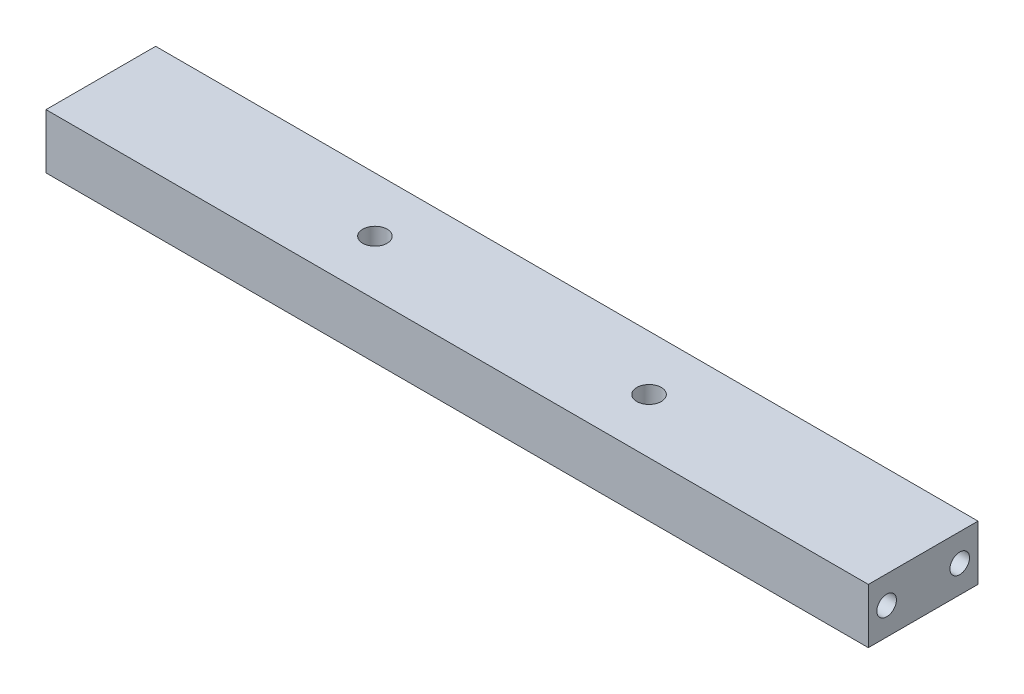
ISO-10303-21;
HEADER;
FILE_DESCRIPTION(('STEP AP214'),'2;1');
FILE_NAME('part.step','',(''),(''),'','','');
FILE_SCHEMA(('AUTOMOTIVE_DESIGN { 1 0 10303 214 1 1 1 1 }'));
ENDSEC;
DATA;
#1=APPLICATION_CONTEXT('core data for automotive mechanical design processes');
#2=APPLICATION_PROTOCOL_DEFINITION('international standard','automotive_design',2000,#1);
#3=PRODUCT_CONTEXT('',#1,'mechanical');
#4=PRODUCT('Part','Part','',(#3));
#5=PRODUCT_RELATED_PRODUCT_CATEGORY('part','',(#4));
#6=PRODUCT_DEFINITION_FORMATION('','',#4);
#7=PRODUCT_DEFINITION_CONTEXT('part definition',#1,'design');
#8=PRODUCT_DEFINITION('design','',#6,#7);
#9=PRODUCT_DEFINITION_SHAPE('','',#8);
#10=(LENGTH_UNIT() NAMED_UNIT(*) SI_UNIT(.MILLI.,.METRE.));
#11=(NAMED_UNIT(*) PLANE_ANGLE_UNIT() SI_UNIT($,.RADIAN.));
#12=(NAMED_UNIT(*) SI_UNIT($,.STERADIAN.) SOLID_ANGLE_UNIT());
#13=UNCERTAINTY_MEASURE_WITH_UNIT(LENGTH_MEASURE(1.E-05),#10,'distance_accuracy_value','');
#14=(GEOMETRIC_REPRESENTATION_CONTEXT(3) GLOBAL_UNCERTAINTY_ASSIGNED_CONTEXT((#13)) GLOBAL_UNIT_ASSIGNED_CONTEXT((#10,
#11,#12)) REPRESENTATION_CONTEXT('',''));
#15=CARTESIAN_POINT('',(0.,0.,0.));
#16=DIRECTION('',(0.,0.,1.));
#17=DIRECTION('',(1.,0.,0.));
#18=AXIS2_PLACEMENT_3D('',#15,#16,#17);
#19=CARTESIAN_POINT('',(142.875,9.525,19.05));
#20=DIRECTION('',(0.,0.,-1.));
#21=DIRECTION('',(0.,1.,0.));
#22=AXIS2_PLACEMENT_3D('',#19,#20,#21);
#23=PLANE('',#22);
#24=DIRECTION('',(0.,-1.,0.));
#25=VECTOR('',#24,1.);
#26=CARTESIAN_POINT('',(-142.875,9.525,19.05));
#27=LINE('',#26,#25);
#28=CARTESIAN_POINT('',(-142.875,9.525,19.05));
#29=VERTEX_POINT('',#28);
#30=CARTESIAN_POINT('',(-142.875,-9.525,19.05));
#31=VERTEX_POINT('',#30);
#32=EDGE_CURVE('E197',#29,#31,#27,.T.);
#33=ORIENTED_EDGE('',*,*,#32,.T.);
#34=DIRECTION('',(-1.,0.,0.));
#35=VECTOR('',#34,1.);
#36=CARTESIAN_POINT('',(142.875,-9.525,19.05));
#37=LINE('',#36,#35);
#38=CARTESIAN_POINT('',(142.875,-9.525,19.05));
#39=VERTEX_POINT('',#38);
#40=EDGE_CURVE('E11',#39,#31,#37,.T.);
#41=ORIENTED_EDGE('',*,*,#40,.F.);
#42=DIRECTION('',(0.,-1.,0.));
#43=VECTOR('',#42,1.);
#44=CARTESIAN_POINT('',(142.875,9.525,19.05));
#45=LINE('',#44,#43);
#46=CARTESIAN_POINT('',(142.875,9.525,19.05));
#47=VERTEX_POINT('',#46);
#48=EDGE_CURVE('E198',#47,#39,#45,.T.);
#49=ORIENTED_EDGE('',*,*,#48,.F.);
#50=DIRECTION('',(-1.,0.,0.));
#51=VECTOR('',#50,1.);
#52=CARTESIAN_POINT('',(142.875,9.525,19.05));
#53=LINE('',#52,#51);
#54=EDGE_CURVE('E204',#47,#29,#53,.T.);
#55=ORIENTED_EDGE('',*,*,#54,.T.);
#56=EDGE_LOOP('',(#33,#41,#49,#55));
#57=FACE_BOUND('',#56,.T.);
#58=ADVANCED_FACE('F38',(#57),#23,.F.);
#59=CARTESIAN_POINT('',(142.875,-9.525,19.05));
#60=DIRECTION('',(0.,1.,0.));
#61=DIRECTION('',(0.,0.,1.));
#62=AXIS2_PLACEMENT_3D('',#59,#60,#61);
#63=PLANE('',#62);
#64=CARTESIAN_POINT('',(19.05,-9.525,-12.7));
#65=DIRECTION('',(0.,-1.,0.));
#66=DIRECTION('',(0.,0.,-1.));
#67=AXIS2_PLACEMENT_3D('',#64,#65,#66);
#68=CIRCLE('',#67,2.1);
#69=CARTESIAN_POINT('',(19.05,-9.525,-14.8));
#70=VERTEX_POINT('',#69);
#71=EDGE_CURVE('E127',#70,#70,#68,.T.);
#72=ORIENTED_EDGE('',*,*,#71,.F.);
#73=EDGE_LOOP('',(#72));
#74=FACE_BOUND('',#73,.T.);
#75=CARTESIAN_POINT('',(-19.05,-9.525,-12.7));
#76=DIRECTION('',(0.,-1.,0.));
#77=DIRECTION('',(0.,0.,-1.));
#78=AXIS2_PLACEMENT_3D('',#75,#76,#77);
#79=CIRCLE('',#78,2.1);
#80=CARTESIAN_POINT('',(-19.05,-9.525,-14.8));
#81=VERTEX_POINT('',#80);
#82=EDGE_CURVE('E126',#81,#81,#79,.T.);
#83=ORIENTED_EDGE('',*,*,#82,.F.);
#84=EDGE_LOOP('',(#83));
#85=FACE_BOUND('',#84,.T.);
#86=CARTESIAN_POINT('',(-19.05,-9.525,12.7));
#87=DIRECTION('',(0.,-1.,0.));
#88=DIRECTION('',(0.,0.,-1.));
#89=AXIS2_PLACEMENT_3D('',#86,#87,#88);
#90=CIRCLE('',#89,2.1);
#91=CARTESIAN_POINT('',(-19.05,-9.525,10.6));
#92=VERTEX_POINT('',#91);
#93=EDGE_CURVE('E137',#92,#92,#90,.T.);
#94=ORIENTED_EDGE('',*,*,#93,.F.);
#95=EDGE_LOOP('',(#94));
#96=FACE_BOUND('',#95,.T.);
#97=CARTESIAN_POINT('',(19.05,-9.525,12.7));
#98=DIRECTION('',(0.,-1.,0.));
#99=DIRECTION('',(0.,0.,-1.));
#100=AXIS2_PLACEMENT_3D('',#97,#98,#99);
#101=CIRCLE('',#100,2.1);
#102=CARTESIAN_POINT('',(19.05,-9.525,10.6));
#103=VERTEX_POINT('',#102);
#104=EDGE_CURVE('E143',#103,#103,#101,.T.);
#105=ORIENTED_EDGE('',*,*,#104,.F.);
#106=EDGE_LOOP('',(#105));
#107=FACE_BOUND('',#106,.T.);
#108=CARTESIAN_POINT('',(-47.625,-9.525,0.));
#109=DIRECTION('',(0.,1.,0.));
#110=DIRECTION('',(0.,0.,1.));
#111=AXIS2_PLACEMENT_3D('',#108,#109,#110);
#112=CIRCLE('',#111,4.25);
#113=CARTESIAN_POINT('',(-47.625,-9.525,4.25));
#114=VERTEX_POINT('',#113);
#115=EDGE_CURVE('E164',#114,#114,#112,.T.);
#116=ORIENTED_EDGE('',*,*,#115,.T.);
#117=EDGE_LOOP('',(#116));
#118=FACE_BOUND('',#117,.T.);
#119=CARTESIAN_POINT('',(47.625,-9.525,0.));
#120=DIRECTION('',(0.,1.,0.));
#121=DIRECTION('',(0.,0.,1.));
#122=AXIS2_PLACEMENT_3D('',#119,#120,#121);
#123=CIRCLE('',#122,4.25);
#124=CARTESIAN_POINT('',(47.625,-9.525,4.25));
#125=VERTEX_POINT('',#124);
#126=EDGE_CURVE('E170',#125,#125,#123,.T.);
#127=ORIENTED_EDGE('',*,*,#126,.T.);
#128=EDGE_LOOP('',(#127));
#129=FACE_BOUND('',#128,.T.);
#130=DIRECTION('',(0.,0.,-1.));
#131=VECTOR('',#130,1.);
#132=CARTESIAN_POINT('',(-142.875,-9.525,19.05));
#133=LINE('',#132,#131);
#134=CARTESIAN_POINT('',(-142.875,-9.525,-19.05));
#135=VERTEX_POINT('',#134);
#136=EDGE_CURVE('E207',#31,#135,#133,.T.);
#137=ORIENTED_EDGE('',*,*,#136,.T.);
#138=DIRECTION('',(-1.,0.,0.));
#139=VECTOR('',#138,1.);
#140=CARTESIAN_POINT('',(142.875,-9.525,-19.05));
#141=LINE('',#140,#139);
#142=CARTESIAN_POINT('',(142.875,-9.525,-19.05));
#143=VERTEX_POINT('',#142);
#144=EDGE_CURVE('E46',#143,#135,#141,.T.);
#145=ORIENTED_EDGE('',*,*,#144,.F.);
#146=DIRECTION('',(0.,0.,-1.));
#147=VECTOR('',#146,1.);
#148=CARTESIAN_POINT('',(142.875,-9.525,19.05));
#149=LINE('',#148,#147);
#150=EDGE_CURVE('E85',#39,#143,#149,.T.);
#151=ORIENTED_EDGE('',*,*,#150,.F.);
#152=ORIENTED_EDGE('',*,*,#40,.T.);
#153=EDGE_LOOP('',(#137,#145,#151,#152));
#154=FACE_BOUND('',#153,.T.);
#155=ADVANCED_FACE('F232',(#74,#85,#96,#107,#118,#129,#154),#63,.F.);
#156=CARTESIAN_POINT('',(142.875,9.525,-19.05));
#157=DIRECTION('',(0.,0.,1.));
#158=DIRECTION('',(0.,-1.,0.));
#159=AXIS2_PLACEMENT_3D('',#156,#157,#158);
#160=PLANE('',#159);
#161=CARTESIAN_POINT('',(63.5,0.,-19.05));
#162=DIRECTION('',(0.,0.,-1.));
#163=DIRECTION('',(-1.,0.,0.));
#164=AXIS2_PLACEMENT_3D('',#161,#162,#163);
#165=CIRCLE('',#164,2.1);
#166=CARTESIAN_POINT('',(61.4,0.,-19.05));
#167=VERTEX_POINT('',#166);
#168=EDGE_CURVE('E149',#167,#167,#165,.T.);
#169=ORIENTED_EDGE('',*,*,#168,.F.);
#170=EDGE_LOOP('',(#169));
#171=FACE_BOUND('',#170,.T.);
#172=CARTESIAN_POINT('',(-63.5,0.,-19.05));
#173=DIRECTION('',(0.,0.,-1.));
#174=DIRECTION('',(-1.,0.,0.));
#175=AXIS2_PLACEMENT_3D('',#172,#173,#174);
#176=CIRCLE('',#175,2.1);
#177=CARTESIAN_POINT('',(-65.6,0.,-19.05));
#178=VERTEX_POINT('',#177);
#179=EDGE_CURVE('E155',#178,#178,#176,.T.);
#180=ORIENTED_EDGE('',*,*,#179,.F.);
#181=EDGE_LOOP('',(#180));
#182=FACE_BOUND('',#181,.T.);
#183=DIRECTION('',(0.,1.,0.));
#184=VECTOR('',#183,1.);
#185=CARTESIAN_POINT('',(-142.875,9.525,-19.05));
#186=LINE('',#185,#184);
#187=CARTESIAN_POINT('',(-142.875,9.525,-19.05));
#188=VERTEX_POINT('',#187);
#189=EDGE_CURVE('E72',#135,#188,#186,.T.);
#190=ORIENTED_EDGE('',*,*,#189,.T.);
#191=DIRECTION('',(-1.,0.,0.));
#192=VECTOR('',#191,1.);
#193=CARTESIAN_POINT('',(142.875,9.525,-19.05));
#194=LINE('',#193,#192);
#195=CARTESIAN_POINT('',(142.875,9.525,-19.05));
#196=VERTEX_POINT('',#195);
#197=EDGE_CURVE('E212',#196,#188,#194,.T.);
#198=ORIENTED_EDGE('',*,*,#197,.F.);
#199=DIRECTION('',(0.,1.,0.));
#200=VECTOR('',#199,1.);
#201=CARTESIAN_POINT('',(142.875,9.525,-19.05));
#202=LINE('',#201,#200);
#203=EDGE_CURVE('E201',#143,#196,#202,.T.);
#204=ORIENTED_EDGE('',*,*,#203,.F.);
#205=ORIENTED_EDGE('',*,*,#144,.T.);
#206=EDGE_LOOP('',(#190,#198,#204,#205));
#207=FACE_BOUND('',#206,.T.);
#208=ADVANCED_FACE('F214',(#171,#182,#207),#160,.F.);
#209=CARTESIAN_POINT('',(142.875,9.525,19.05));
#210=DIRECTION('',(0.,-1.,0.));
#211=DIRECTION('',(0.,0.,-1.));
#212=AXIS2_PLACEMENT_3D('',#209,#210,#211);
#213=PLANE('',#212);
#214=CARTESIAN_POINT('',(-47.625,9.525,0.));
#215=DIRECTION('',(0.,1.,0.));
#216=DIRECTION('',(0.,0.,1.));
#217=AXIS2_PLACEMENT_3D('',#214,#215,#216);
#218=CIRCLE('',#217,4.24999999999999);
#219=CARTESIAN_POINT('',(-47.625,9.525,4.24999999999999));
#220=VERTEX_POINT('',#219);
#221=EDGE_CURVE('E161',#220,#220,#218,.T.);
#222=ORIENTED_EDGE('',*,*,#221,.F.);
#223=EDGE_LOOP('',(#222));
#224=FACE_BOUND('',#223,.T.);
#225=CARTESIAN_POINT('',(47.625,9.525,0.));
#226=DIRECTION('',(0.,1.,0.));
#227=DIRECTION('',(0.,0.,1.));
#228=AXIS2_PLACEMENT_3D('',#225,#226,#227);
#229=CIRCLE('',#228,4.24999999999999);
#230=CARTESIAN_POINT('',(47.625,9.525,4.24999999999999));
#231=VERTEX_POINT('',#230);
#232=EDGE_CURVE('E167',#231,#231,#229,.T.);
#233=ORIENTED_EDGE('',*,*,#232,.F.);
#234=EDGE_LOOP('',(#233));
#235=FACE_BOUND('',#234,.T.);
#236=DIRECTION('',(0.,0.,1.));
#237=VECTOR('',#236,1.);
#238=CARTESIAN_POINT('',(-142.875,9.525,19.05));
#239=LINE('',#238,#237);
#240=EDGE_CURVE('E78',#188,#29,#239,.T.);
#241=ORIENTED_EDGE('',*,*,#240,.T.);
#242=ORIENTED_EDGE('',*,*,#54,.F.);
#243=DIRECTION('',(0.,0.,1.));
#244=VECTOR('',#243,1.);
#245=CARTESIAN_POINT('',(142.875,9.525,19.05));
#246=LINE('',#245,#244);
#247=EDGE_CURVE('E54',#196,#47,#246,.T.);
#248=ORIENTED_EDGE('',*,*,#247,.F.);
#249=ORIENTED_EDGE('',*,*,#197,.T.);
#250=EDGE_LOOP('',(#241,#242,#248,#249));
#251=FACE_BOUND('',#250,.T.);
#252=ADVANCED_FACE('F221',(#224,#235,#251),#213,.F.);
#253=CARTESIAN_POINT('',(142.875,9.525,19.05));
#254=DIRECTION('',(1.,0.,0.));
#255=DIRECTION('',(0.,0.,-1.));
#256=AXIS2_PLACEMENT_3D('',#253,#254,#255);
#257=PLANE('',#256);
#258=CARTESIAN_POINT('',(142.875,0.,12.7));
#259=DIRECTION('',(1.,0.,0.));
#260=DIRECTION('',(0.,0.,-1.));
#261=AXIS2_PLACEMENT_3D('',#258,#259,#260);
#262=CIRCLE('',#261,3.4);
#263=CARTESIAN_POINT('',(142.875,0.,9.3));
#264=VERTEX_POINT('',#263);
#265=EDGE_CURVE('E188',#264,#264,#262,.T.);
#266=ORIENTED_EDGE('',*,*,#265,.F.);
#267=EDGE_LOOP('',(#266));
#268=FACE_BOUND('',#267,.T.);
#269=CARTESIAN_POINT('',(142.875,0.,-12.7));
#270=DIRECTION('',(1.,0.,0.));
#271=DIRECTION('',(0.,0.,-1.));
#272=AXIS2_PLACEMENT_3D('',#269,#270,#271);
#273=CIRCLE('',#272,3.4);
#274=CARTESIAN_POINT('',(142.875,0.,-16.1));
#275=VERTEX_POINT('',#274);
#276=EDGE_CURVE('E194',#275,#275,#273,.T.);
#277=ORIENTED_EDGE('',*,*,#276,.F.);
#278=EDGE_LOOP('',(#277));
#279=FACE_BOUND('',#278,.T.);
#280=ORIENTED_EDGE('',*,*,#48,.T.);
#281=ORIENTED_EDGE('',*,*,#150,.T.);
#282=ORIENTED_EDGE('',*,*,#203,.T.);
#283=ORIENTED_EDGE('',*,*,#247,.T.);
#284=EDGE_LOOP('',(#280,#281,#282,#283));
#285=FACE_BOUND('',#284,.T.);
#286=ADVANCED_FACE('F223',(#268,#279,#285),#257,.T.);
#287=CARTESIAN_POINT('',(-142.875,9.525,19.05));
#288=DIRECTION('',(1.,0.,0.));
#289=DIRECTION('',(0.,0.,-1.));
#290=AXIS2_PLACEMENT_3D('',#287,#288,#289);
#291=PLANE('',#290);
#292=CARTESIAN_POINT('',(-142.875,0.,12.7));
#293=DIRECTION('',(-1.,0.,0.));
#294=DIRECTION('',(0.,0.,1.));
#295=AXIS2_PLACEMENT_3D('',#292,#293,#294);
#296=CIRCLE('',#295,3.4);
#297=CARTESIAN_POINT('',(-142.875,0.,16.1));
#298=VERTEX_POINT('',#297);
#299=EDGE_CURVE('E176',#298,#298,#296,.T.);
#300=ORIENTED_EDGE('',*,*,#299,.F.);
#301=EDGE_LOOP('',(#300));
#302=FACE_BOUND('',#301,.T.);
#303=CARTESIAN_POINT('',(-142.875,0.,-12.7));
#304=DIRECTION('',(-1.,0.,0.));
#305=DIRECTION('',(0.,0.,1.));
#306=AXIS2_PLACEMENT_3D('',#303,#304,#305);
#307=CIRCLE('',#306,3.4);
#308=CARTESIAN_POINT('',(-142.875,0.,-9.3));
#309=VERTEX_POINT('',#308);
#310=EDGE_CURVE('E182',#309,#309,#307,.T.);
#311=ORIENTED_EDGE('',*,*,#310,.F.);
#312=EDGE_LOOP('',(#311));
#313=FACE_BOUND('',#312,.T.);
#314=ORIENTED_EDGE('',*,*,#32,.F.);
#315=ORIENTED_EDGE('',*,*,#240,.F.);
#316=ORIENTED_EDGE('',*,*,#189,.F.);
#317=ORIENTED_EDGE('',*,*,#136,.F.);
#318=EDGE_LOOP('',(#314,#315,#316,#317));
#319=FACE_BOUND('',#318,.T.);
#320=ADVANCED_FACE('F217',(#302,#313,#319),#291,.F.);
#321=CARTESIAN_POINT('',(142.875,0.,-12.7));
#322=DIRECTION('',(1.,0.,0.));
#323=DIRECTION('',(0.,0.,-1.));
#324=AXIS2_PLACEMENT_3D('',#321,#322,#323);
#325=CYLINDRICAL_SURFACE('',#324,3.4);
#326=CARTESIAN_POINT('',(123.1138,0.,-12.7));
#327=DIRECTION('',(1.,0.,0.));
#328=DIRECTION('',(0.,0.,-1.));
#329=AXIS2_PLACEMENT_3D('',#326,#327,#328);
#330=CIRCLE('',#329,3.4);
#331=CARTESIAN_POINT('',(123.1138,0.,-16.1));
#332=VERTEX_POINT('',#331);
#333=EDGE_CURVE('E191',#332,#332,#330,.T.);
#334=ORIENTED_EDGE('',*,*,#333,.F.);
#335=EDGE_LOOP('',(#334));
#336=FACE_BOUND('',#335,.T.);
#337=ORIENTED_EDGE('',*,*,#276,.T.);
#338=EDGE_LOOP('',(#337));
#339=FACE_BOUND('',#338,.T.);
#340=ADVANCED_FACE('F298',(#336,#339),#325,.F.);
#341=CARTESIAN_POINT('',(123.1138,0.,-12.7));
#342=DIRECTION('',(1.,0.,0.));
#343=DIRECTION('',(0.,0.,-1.));
#344=AXIS2_PLACEMENT_3D('',#341,#342,#343);
#345=CONICAL_SURFACE('',#344,3.4,1.02974425867665);
#346=CARTESIAN_POINT('',(121.070873895306,0.,-12.7));
#347=VERTEX_POINT('',#346);
#348=VERTEX_LOOP('',#347);
#349=FACE_BOUND('',#348,.T.);
#350=ORIENTED_EDGE('',*,*,#333,.T.);
#351=EDGE_LOOP('',(#350));
#352=FACE_BOUND('',#351,.T.);
#353=ADVANCED_FACE('F294',(#349,#352),#345,.F.);
#354=CARTESIAN_POINT('',(142.875,0.,12.7));
#355=DIRECTION('',(1.,0.,0.));
#356=DIRECTION('',(0.,0.,-1.));
#357=AXIS2_PLACEMENT_3D('',#354,#355,#356);
#358=CYLINDRICAL_SURFACE('',#357,3.4);
#359=CARTESIAN_POINT('',(123.1138,0.,12.7));
#360=DIRECTION('',(1.,0.,0.));
#361=DIRECTION('',(0.,0.,-1.));
#362=AXIS2_PLACEMENT_3D('',#359,#360,#361);
#363=CIRCLE('',#362,3.4);
#364=CARTESIAN_POINT('',(123.1138,0.,9.3));
#365=VERTEX_POINT('',#364);
#366=EDGE_CURVE('E185',#365,#365,#363,.T.);
#367=ORIENTED_EDGE('',*,*,#366,.F.);
#368=EDGE_LOOP('',(#367));
#369=FACE_BOUND('',#368,.T.);
#370=ORIENTED_EDGE('',*,*,#265,.T.);
#371=EDGE_LOOP('',(#370));
#372=FACE_BOUND('',#371,.T.);
#373=ADVANCED_FACE('F290',(#369,#372),#358,.F.);
#374=CARTESIAN_POINT('',(123.1138,0.,12.7));
#375=DIRECTION('',(1.,0.,0.));
#376=DIRECTION('',(0.,0.,-1.));
#377=AXIS2_PLACEMENT_3D('',#374,#375,#376);
#378=CONICAL_SURFACE('',#377,3.4,1.02974425867665);
#379=CARTESIAN_POINT('',(121.070873895306,0.,12.7));
#380=VERTEX_POINT('',#379);
#381=VERTEX_LOOP('',#380);
#382=FACE_BOUND('',#381,.T.);
#383=ORIENTED_EDGE('',*,*,#366,.T.);
#384=EDGE_LOOP('',(#383));
#385=FACE_BOUND('',#384,.T.);
#386=ADVANCED_FACE('F286',(#382,#385),#378,.F.);
#387=CARTESIAN_POINT('',(-142.875,0.,-12.7));
#388=DIRECTION('',(-1.,0.,0.));
#389=DIRECTION('',(0.,0.,1.));
#390=AXIS2_PLACEMENT_3D('',#387,#388,#389);
#391=CYLINDRICAL_SURFACE('',#390,3.4);
#392=CARTESIAN_POINT('',(-123.1138,0.,-12.7));
#393=DIRECTION('',(-1.,0.,0.));
#394=DIRECTION('',(0.,0.,1.));
#395=AXIS2_PLACEMENT_3D('',#392,#393,#394);
#396=CIRCLE('',#395,3.4);
#397=CARTESIAN_POINT('',(-123.1138,0.,-9.3));
#398=VERTEX_POINT('',#397);
#399=EDGE_CURVE('E179',#398,#398,#396,.T.);
#400=ORIENTED_EDGE('',*,*,#399,.F.);
#401=EDGE_LOOP('',(#400));
#402=FACE_BOUND('',#401,.T.);
#403=ORIENTED_EDGE('',*,*,#310,.T.);
#404=EDGE_LOOP('',(#403));
#405=FACE_BOUND('',#404,.T.);
#406=ADVANCED_FACE('F282',(#402,#405),#391,.F.);
#407=CARTESIAN_POINT('',(-123.1138,0.,-12.7));
#408=DIRECTION('',(-1.,0.,0.));
#409=DIRECTION('',(0.,0.,1.));
#410=AXIS2_PLACEMENT_3D('',#407,#408,#409);
#411=CONICAL_SURFACE('',#410,3.4,1.02974425867665);
#412=CARTESIAN_POINT('',(-121.070873895306,0.,-12.7));
#413=VERTEX_POINT('',#412);
#414=VERTEX_LOOP('',#413);
#415=FACE_BOUND('',#414,.T.);
#416=ORIENTED_EDGE('',*,*,#399,.T.);
#417=EDGE_LOOP('',(#416));
#418=FACE_BOUND('',#417,.T.);
#419=ADVANCED_FACE('F278',(#415,#418),#411,.F.);
#420=CARTESIAN_POINT('',(-142.875,0.,12.7));
#421=DIRECTION('',(-1.,0.,0.));
#422=DIRECTION('',(0.,0.,1.));
#423=AXIS2_PLACEMENT_3D('',#420,#421,#422);
#424=CYLINDRICAL_SURFACE('',#423,3.4);
#425=CARTESIAN_POINT('',(-123.1138,0.,12.7));
#426=DIRECTION('',(-1.,0.,0.));
#427=DIRECTION('',(0.,0.,1.));
#428=AXIS2_PLACEMENT_3D('',#425,#426,#427);
#429=CIRCLE('',#428,3.4);
#430=CARTESIAN_POINT('',(-123.1138,0.,16.1));
#431=VERTEX_POINT('',#430);
#432=EDGE_CURVE('E173',#431,#431,#429,.T.);
#433=ORIENTED_EDGE('',*,*,#432,.F.);
#434=EDGE_LOOP('',(#433));
#435=FACE_BOUND('',#434,.T.);
#436=ORIENTED_EDGE('',*,*,#299,.T.);
#437=EDGE_LOOP('',(#436));
#438=FACE_BOUND('',#437,.T.);
#439=ADVANCED_FACE('F271',(#435,#438),#424,.F.);
#440=CARTESIAN_POINT('',(-123.1138,0.,12.7));
#441=DIRECTION('',(-1.,0.,0.));
#442=DIRECTION('',(0.,0.,1.));
#443=AXIS2_PLACEMENT_3D('',#440,#441,#442);
#444=CONICAL_SURFACE('',#443,3.4,1.02974425867665);
#445=CARTESIAN_POINT('',(-121.070873895306,0.,12.7));
#446=VERTEX_POINT('',#445);
#447=VERTEX_LOOP('',#446);
#448=FACE_BOUND('',#447,.T.);
#449=ORIENTED_EDGE('',*,*,#432,.T.);
#450=EDGE_LOOP('',(#449));
#451=FACE_BOUND('',#450,.T.);
#452=ADVANCED_FACE('F261',(#448,#451),#444,.F.);
#453=CARTESIAN_POINT('',(47.625,9.525,0.));
#454=DIRECTION('',(0.,1.,0.));
#455=DIRECTION('',(0.,0.,1.));
#456=AXIS2_PLACEMENT_3D('',#453,#454,#455);
#457=CYLINDRICAL_SURFACE('',#456,4.24999999999999);
#458=ORIENTED_EDGE('',*,*,#126,.F.);
#459=EDGE_LOOP('',(#458));
#460=FACE_BOUND('',#459,.T.);
#461=ORIENTED_EDGE('',*,*,#232,.T.);
#462=EDGE_LOOP('',(#461));
#463=FACE_BOUND('',#462,.T.);
#464=ADVANCED_FACE('F257',(#460,#463),#457,.F.);
#465=CARTESIAN_POINT('',(-47.625,9.525,0.));
#466=DIRECTION('',(0.,1.,0.));
#467=DIRECTION('',(0.,0.,1.));
#468=AXIS2_PLACEMENT_3D('',#465,#466,#467);
#469=CYLINDRICAL_SURFACE('',#468,4.24999999999999);
#470=ORIENTED_EDGE('',*,*,#115,.F.);
#471=EDGE_LOOP('',(#470));
#472=FACE_BOUND('',#471,.T.);
#473=ORIENTED_EDGE('',*,*,#221,.T.);
#474=EDGE_LOOP('',(#473));
#475=FACE_BOUND('',#474,.T.);
#476=ADVANCED_FACE('F260',(#472,#475),#469,.F.);
#477=CARTESIAN_POINT('',(-63.5,0.,-6.6548));
#478=DIRECTION('',(0.,0.,-1.));
#479=DIRECTION('',(-1.,0.,0.));
#480=AXIS2_PLACEMENT_3D('',#477,#478,#479);
#481=CONICAL_SURFACE('',#480,2.1,1.02974425867665);
#482=CARTESIAN_POINT('',(-63.5,0.,-5.39299270004213));
#483=VERTEX_POINT('',#482);
#484=VERTEX_LOOP('',#483);
#485=FACE_BOUND('',#484,.T.);
#486=CARTESIAN_POINT('',(-63.5,0.,-6.6548));
#487=DIRECTION('',(0.,0.,-1.));
#488=DIRECTION('',(-1.,0.,0.));
#489=AXIS2_PLACEMENT_3D('',#486,#487,#488);
#490=CIRCLE('',#489,2.1);
#491=CARTESIAN_POINT('',(-65.6,0.,-6.6548));
#492=VERTEX_POINT('',#491);
#493=EDGE_CURVE('E158',#492,#492,#490,.T.);
#494=ORIENTED_EDGE('',*,*,#493,.T.);
#495=EDGE_LOOP('',(#494));
#496=FACE_BOUND('',#495,.T.);
#497=ADVANCED_FACE('F268',(#485,#496),#481,.F.);
#498=CARTESIAN_POINT('',(-63.5,0.,-19.05));
#499=DIRECTION('',(0.,0.,-1.));
#500=DIRECTION('',(-1.,0.,0.));
#501=AXIS2_PLACEMENT_3D('',#498,#499,#500);
#502=CYLINDRICAL_SURFACE('',#501,2.1);
#503=ORIENTED_EDGE('',*,*,#493,.F.);
#504=EDGE_LOOP('',(#503));
#505=FACE_BOUND('',#504,.T.);
#506=ORIENTED_EDGE('',*,*,#179,.T.);
#507=EDGE_LOOP('',(#506));
#508=FACE_BOUND('',#507,.T.);
#509=ADVANCED_FACE('F383',(#505,#508),#502,.F.);
#510=CARTESIAN_POINT('',(63.5,0.,-6.6548));
#511=DIRECTION('',(0.,0.,-1.));
#512=DIRECTION('',(-1.,0.,0.));
#513=AXIS2_PLACEMENT_3D('',#510,#511,#512);
#514=CONICAL_SURFACE('',#513,2.09999999999999,1.02974425867665);
#515=CARTESIAN_POINT('',(63.5,0.,-5.39299270004213));
#516=VERTEX_POINT('',#515);
#517=VERTEX_LOOP('',#516);
#518=FACE_BOUND('',#517,.T.);
#519=CARTESIAN_POINT('',(63.5,0.,-6.6548));
#520=DIRECTION('',(0.,0.,-1.));
#521=DIRECTION('',(-1.,0.,0.));
#522=AXIS2_PLACEMENT_3D('',#519,#520,#521);
#523=CIRCLE('',#522,2.09999999999999);
#524=CARTESIAN_POINT('',(61.4,0.,-6.6548));
#525=VERTEX_POINT('',#524);
#526=EDGE_CURVE('E152',#525,#525,#523,.T.);
#527=ORIENTED_EDGE('',*,*,#526,.T.);
#528=EDGE_LOOP('',(#527));
#529=FACE_BOUND('',#528,.T.);
#530=ADVANCED_FACE('F393',(#518,#529),#514,.F.);
#531=CARTESIAN_POINT('',(63.5,0.,-19.05));
#532=DIRECTION('',(0.,0.,-1.));
#533=DIRECTION('',(-1.,0.,0.));
#534=AXIS2_PLACEMENT_3D('',#531,#532,#533);
#535=CYLINDRICAL_SURFACE('',#534,2.1);
#536=ORIENTED_EDGE('',*,*,#526,.F.);
#537=EDGE_LOOP('',(#536));
#538=FACE_BOUND('',#537,.T.);
#539=ORIENTED_EDGE('',*,*,#168,.T.);
#540=EDGE_LOOP('',(#539));
#541=FACE_BOUND('',#540,.T.);
#542=ADVANCED_FACE('F404',(#538,#541),#535,.F.);
#543=CARTESIAN_POINT('',(19.05,2.8702,12.7));
#544=DIRECTION('',(0.,-1.,0.));
#545=DIRECTION('',(0.,0.,-1.));
#546=AXIS2_PLACEMENT_3D('',#543,#544,#545);
#547=CONICAL_SURFACE('',#546,2.1,1.02974425867665);
#548=CARTESIAN_POINT('',(19.05,4.13200729995787,12.7));
#549=VERTEX_POINT('',#548);
#550=VERTEX_LOOP('',#549);
#551=FACE_BOUND('',#550,.T.);
#552=CARTESIAN_POINT('',(19.05,2.8702,12.7));
#553=DIRECTION('',(0.,-1.,0.));
#554=DIRECTION('',(0.,0.,-1.));
#555=AXIS2_PLACEMENT_3D('',#552,#553,#554);
#556=CIRCLE('',#555,2.1);
#557=CARTESIAN_POINT('',(19.05,2.8702,10.6));
#558=VERTEX_POINT('',#557);
#559=EDGE_CURVE('E146',#558,#558,#556,.T.);
#560=ORIENTED_EDGE('',*,*,#559,.T.);
#561=EDGE_LOOP('',(#560));
#562=FACE_BOUND('',#561,.T.);
#563=ADVANCED_FACE('F414',(#551,#562),#547,.F.);
#564=CARTESIAN_POINT('',(19.05,-9.525,12.7));
#565=DIRECTION('',(0.,-1.,0.));
#566=DIRECTION('',(0.,0.,-1.));
#567=AXIS2_PLACEMENT_3D('',#564,#565,#566);
#568=CYLINDRICAL_SURFACE('',#567,2.1);
#569=ORIENTED_EDGE('',*,*,#559,.F.);
#570=EDGE_LOOP('',(#569));
#571=FACE_BOUND('',#570,.T.);
#572=ORIENTED_EDGE('',*,*,#104,.T.);
#573=EDGE_LOOP('',(#572));
#574=FACE_BOUND('',#573,.T.);
#575=ADVANCED_FACE('F430',(#571,#574),#568,.F.);
#576=CARTESIAN_POINT('',(-19.05,2.8702,12.7));
#577=DIRECTION('',(0.,-1.,0.));
#578=DIRECTION('',(0.,0.,-1.));
#579=AXIS2_PLACEMENT_3D('',#576,#577,#578);
#580=CONICAL_SURFACE('',#579,2.1,1.02974425867665);
#581=CARTESIAN_POINT('',(-19.05,4.13200729995787,12.7));
#582=VERTEX_POINT('',#581);
#583=VERTEX_LOOP('',#582);
#584=FACE_BOUND('',#583,.T.);
#585=CARTESIAN_POINT('',(-19.05,2.8702,12.7));
#586=DIRECTION('',(0.,-1.,0.));
#587=DIRECTION('',(0.,0.,-1.));
#588=AXIS2_PLACEMENT_3D('',#585,#586,#587);
#589=CIRCLE('',#588,2.1);
#590=CARTESIAN_POINT('',(-19.05,2.8702,10.6));
#591=VERTEX_POINT('',#590);
#592=EDGE_CURVE('E140',#591,#591,#589,.T.);
#593=ORIENTED_EDGE('',*,*,#592,.T.);
#594=EDGE_LOOP('',(#593));
#595=FACE_BOUND('',#594,.T.);
#596=ADVANCED_FACE('F441',(#584,#595),#580,.F.);
#597=CARTESIAN_POINT('',(-19.05,-9.525,12.7));
#598=DIRECTION('',(0.,-1.,0.));
#599=DIRECTION('',(0.,0.,-1.));
#600=AXIS2_PLACEMENT_3D('',#597,#598,#599);
#601=CYLINDRICAL_SURFACE('',#600,2.1);
#602=ORIENTED_EDGE('',*,*,#592,.F.);
#603=EDGE_LOOP('',(#602));
#604=FACE_BOUND('',#603,.T.);
#605=ORIENTED_EDGE('',*,*,#93,.T.);
#606=EDGE_LOOP('',(#605));
#607=FACE_BOUND('',#606,.T.);
#608=ADVANCED_FACE('F453',(#604,#607),#601,.F.);
#609=CARTESIAN_POINT('',(-19.05,2.8702,-12.7));
#610=DIRECTION('',(0.,-1.,0.));
#611=DIRECTION('',(0.,0.,-1.));
#612=AXIS2_PLACEMENT_3D('',#609,#610,#611);
#613=CONICAL_SURFACE('',#612,2.1,1.02974425867665);
#614=CARTESIAN_POINT('',(-19.05,4.13200729995787,-12.7));
#615=VERTEX_POINT('',#614);
#616=VERTEX_LOOP('',#615);
#617=FACE_BOUND('',#616,.T.);
#618=CARTESIAN_POINT('',(-19.05,2.8702,-12.7));
#619=DIRECTION('',(0.,-1.,0.));
#620=DIRECTION('',(0.,0.,-1.));
#621=AXIS2_PLACEMENT_3D('',#618,#619,#620);
#622=CIRCLE('',#621,2.1);
#623=CARTESIAN_POINT('',(-19.05,2.8702,-14.8));
#624=VERTEX_POINT('',#623);
#625=EDGE_CURVE('E130',#624,#624,#622,.T.);
#626=ORIENTED_EDGE('',*,*,#625,.T.);
#627=EDGE_LOOP('',(#626));
#628=FACE_BOUND('',#627,.T.);
#629=ADVANCED_FACE('F463',(#617,#628),#613,.F.);
#630=CARTESIAN_POINT('',(-19.05,-9.525,-12.7));
#631=DIRECTION('',(0.,-1.,0.));
#632=DIRECTION('',(0.,0.,-1.));
#633=AXIS2_PLACEMENT_3D('',#630,#631,#632);
#634=CYLINDRICAL_SURFACE('',#633,2.1);
#635=ORIENTED_EDGE('',*,*,#625,.F.);
#636=EDGE_LOOP('',(#635));
#637=FACE_BOUND('',#636,.T.);
#638=ORIENTED_EDGE('',*,*,#82,.T.);
#639=EDGE_LOOP('',(#638));
#640=FACE_BOUND('',#639,.T.);
#641=ADVANCED_FACE('F120',(#637,#640),#634,.F.);
#642=CARTESIAN_POINT('',(19.05,2.8702,-12.7));
#643=DIRECTION('',(0.,-1.,0.));
#644=DIRECTION('',(0.,0.,-1.));
#645=AXIS2_PLACEMENT_3D('',#642,#643,#644);
#646=CONICAL_SURFACE('',#645,2.1,1.02974425867665);
#647=CARTESIAN_POINT('',(19.05,4.13200729995787,-12.7));
#648=VERTEX_POINT('',#647);
#649=VERTEX_LOOP('',#648);
#650=FACE_BOUND('',#649,.T.);
#651=CARTESIAN_POINT('',(19.05,2.8702,-12.7));
#652=DIRECTION('',(0.,-1.,0.));
#653=DIRECTION('',(0.,0.,-1.));
#654=AXIS2_PLACEMENT_3D('',#651,#652,#653);
#655=CIRCLE('',#654,2.1);
#656=CARTESIAN_POINT('',(19.05,2.8702,-14.8));
#657=VERTEX_POINT('',#656);
#658=EDGE_CURVE('E124',#657,#657,#655,.T.);
#659=ORIENTED_EDGE('',*,*,#658,.T.);
#660=EDGE_LOOP('',(#659));
#661=FACE_BOUND('',#660,.T.);
#662=ADVANCED_FACE('F116',(#650,#661),#646,.F.);
#663=CARTESIAN_POINT('',(19.05,-9.525,-12.7));
#664=DIRECTION('',(0.,-1.,0.));
#665=DIRECTION('',(0.,0.,-1.));
#666=AXIS2_PLACEMENT_3D('',#663,#664,#665);
#667=CYLINDRICAL_SURFACE('',#666,2.1);
#668=ORIENTED_EDGE('',*,*,#658,.F.);
#669=EDGE_LOOP('',(#668));
#670=FACE_BOUND('',#669,.T.);
#671=ORIENTED_EDGE('',*,*,#71,.T.);
#672=EDGE_LOOP('',(#671));
#673=FACE_BOUND('',#672,.T.);
#674=ADVANCED_FACE('F119',(#670,#673),#667,.F.);
#675=CLOSED_SHELL('',(#58,#155,#208,#252,#286,#320,#340,#353,#373,#386,#406,#419,#439,#452,#464,
#476,#497,#509,#530,#542,#563,#575,#596,#608,#629,#641,#662,#674));
#676=MANIFOLD_SOLID_BREP('B2',#675);
#677=ADVANCED_BREP_SHAPE_REPRESENTATION('',(#18,#676),#14);
#678=SHAPE_DEFINITION_REPRESENTATION(#9,#677);
ENDSEC;
END-ISO-10303-21;
